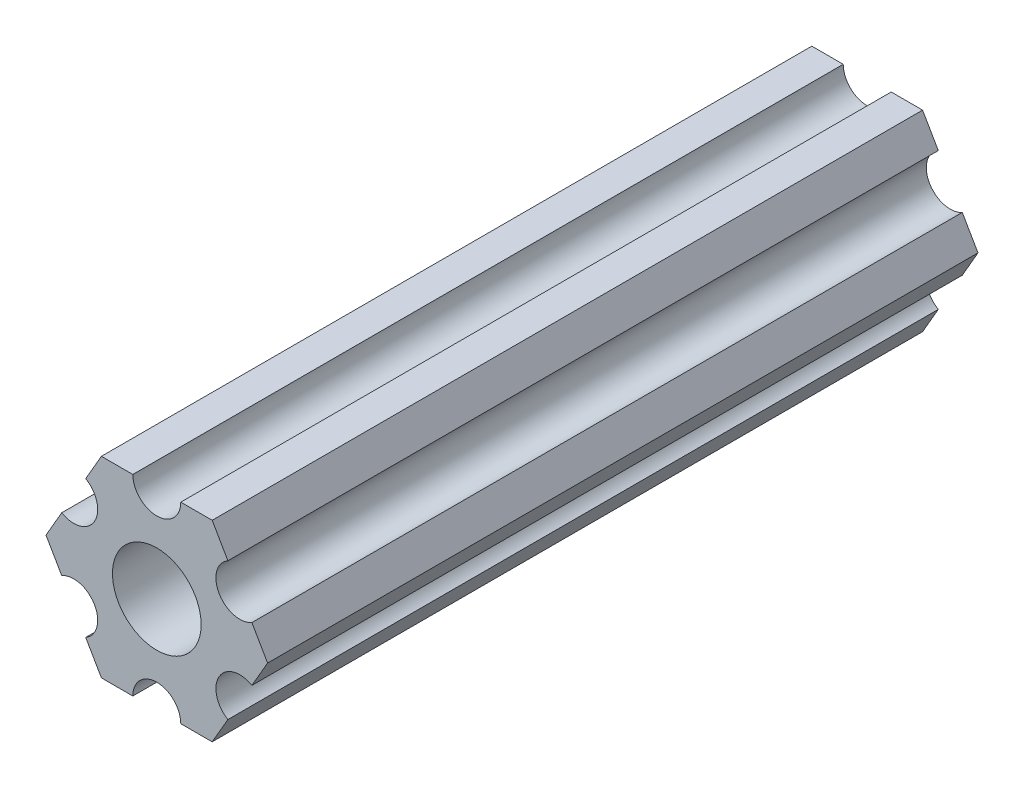
ISO-10303-21;
HEADER;
FILE_DESCRIPTION(('STEP AP214'),'2;1');
FILE_NAME('part.step','',(''),(''),'','','');
FILE_SCHEMA(('AUTOMOTIVE_DESIGN { 1 0 10303 214 1 1 1 1 }'));
ENDSEC;
DATA;
#1=APPLICATION_CONTEXT('core data for automotive mechanical design processes');
#2=APPLICATION_PROTOCOL_DEFINITION('international standard','automotive_design',2000,#1);
#3=PRODUCT_CONTEXT('',#1,'mechanical');
#4=PRODUCT('Part','Part','',(#3));
#5=PRODUCT_RELATED_PRODUCT_CATEGORY('part','',(#4));
#6=PRODUCT_DEFINITION_FORMATION('','',#4);
#7=PRODUCT_DEFINITION_CONTEXT('part definition',#1,'design');
#8=PRODUCT_DEFINITION('design','',#6,#7);
#9=PRODUCT_DEFINITION_SHAPE('','',#8);
#10=(LENGTH_UNIT() NAMED_UNIT(*) SI_UNIT(.MILLI.,.METRE.));
#11=(NAMED_UNIT(*) PLANE_ANGLE_UNIT() SI_UNIT($,.RADIAN.));
#12=(NAMED_UNIT(*) SI_UNIT($,.STERADIAN.) SOLID_ANGLE_UNIT());
#13=UNCERTAINTY_MEASURE_WITH_UNIT(LENGTH_MEASURE(1.E-05),#10,'distance_accuracy_value','');
#14=(GEOMETRIC_REPRESENTATION_CONTEXT(3) GLOBAL_UNCERTAINTY_ASSIGNED_CONTEXT((#13)) GLOBAL_UNIT_ASSIGNED_CONTEXT((#10,
#11,#12)) REPRESENTATION_CONTEXT('',''));
#15=CARTESIAN_POINT('',(0.,0.,0.));
#16=DIRECTION('',(0.,0.,1.));
#17=DIRECTION('',(1.,0.,0.));
#18=AXIS2_PLACEMENT_3D('',#15,#16,#17);
#19=CARTESIAN_POINT('',(5.49926123384919,-3.17500007340606,47.0154));
#20=DIRECTION('',(0.,0.,-1.));
#21=DIRECTION('',(-1.,0.,0.));
#22=AXIS2_PLACEMENT_3D('',#19,#20,#21);
#23=CYLINDRICAL_SURFACE('',#22,1.58750000000001);
#24=CARTESIAN_POINT('',(5.49926123384919,-3.17500007340606,0.));
#25=DIRECTION('',(0.,0.,1.));
#26=DIRECTION('',(1.,0.,0.));
#27=AXIS2_PLACEMENT_3D('',#24,#25,#26);
#28=CIRCLE('',#27,1.58750000000001);
#29=CARTESIAN_POINT('',(6.29301118896201,-1.80018471898264,0.));
#30=VERTEX_POINT('',#29);
#31=CARTESIAN_POINT('',(4.70551127873637,-4.54981542782949,0.));
#32=VERTEX_POINT('',#31);
#33=EDGE_CURVE('E189',#30,#32,#28,.T.);
#34=ORIENTED_EDGE('',*,*,#33,.F.);
#35=DIRECTION('',(0.,0.,-1.));
#36=VECTOR('',#35,1.);
#37=CARTESIAN_POINT('',(6.29301118896201,-1.80018471898264,47.0154));
#38=LINE('',#37,#36);
#39=CARTESIAN_POINT('',(6.29301118896201,-1.80018471898264,47.0154));
#40=VERTEX_POINT('',#39);
#41=EDGE_CURVE('E11',#40,#30,#38,.T.);
#42=ORIENTED_EDGE('',*,*,#41,.F.);
#43=CARTESIAN_POINT('',(5.49926123384919,-3.17500007340606,47.0154));
#44=DIRECTION('',(0.,0.,1.));
#45=DIRECTION('',(1.,0.,0.));
#46=AXIS2_PLACEMENT_3D('',#43,#44,#45);
#47=CIRCLE('',#46,1.58750000000001);
#48=CARTESIAN_POINT('',(4.70551127873637,-4.54981542782949,47.0154));
#49=VERTEX_POINT('',#48);
#50=EDGE_CURVE('E240',#40,#49,#47,.T.);
#51=ORIENTED_EDGE('',*,*,#50,.T.);
#52=DIRECTION('',(0.,0.,-1.));
#53=VECTOR('',#52,1.);
#54=CARTESIAN_POINT('',(4.70551127873637,-4.54981542782949,47.0154));
#55=LINE('',#54,#53);
#56=EDGE_CURVE('E35',#49,#32,#55,.T.);
#57=ORIENTED_EDGE('',*,*,#56,.T.);
#58=EDGE_LOOP('',(#34,#42,#51,#57));
#59=FACE_BOUND('',#58,.T.);
#60=ADVANCED_FACE('F32',(#59),#23,.F.);
#61=CARTESIAN_POINT('',(7.33234824269059,0.,47.0154));
#62=DIRECTION('',(0.866025420109243,-0.499999971724609,0.));
#63=DIRECTION('',(0.499999971724609,0.866025420109243,0.));
#64=AXIS2_PLACEMENT_3D('',#61,#62,#63);
#65=PLANE('',#64);
#66=DIRECTION('',(-0.499999971724609,-0.866025420109243,0.));
#67=VECTOR('',#66,1.);
#68=CARTESIAN_POINT('',(7.33234824269059,0.,0.));
#69=LINE('',#68,#67);
#70=CARTESIAN_POINT('',(7.33234824269059,0.,0.));
#71=VERTEX_POINT('',#70);
#72=EDGE_CURVE('E238',#71,#30,#69,.T.);
#73=ORIENTED_EDGE('',*,*,#72,.F.);
#74=DIRECTION('',(0.,0.,-1.));
#75=VECTOR('',#74,1.);
#76=CARTESIAN_POINT('',(7.33234824269059,0.,47.0154));
#77=LINE('',#76,#75);
#78=CARTESIAN_POINT('',(7.33234824269059,0.,47.0154));
#79=VERTEX_POINT('',#78);
#80=EDGE_CURVE('E41',#79,#71,#77,.T.);
#81=ORIENTED_EDGE('',*,*,#80,.F.);
#82=DIRECTION('',(-0.499999971724609,-0.866025420109243,0.));
#83=VECTOR('',#82,1.);
#84=CARTESIAN_POINT('',(7.33234824269059,0.,47.0154));
#85=LINE('',#84,#83);
#86=EDGE_CURVE('E179',#79,#40,#85,.T.);
#87=ORIENTED_EDGE('',*,*,#86,.T.);
#88=ORIENTED_EDGE('',*,*,#41,.T.);
#89=EDGE_LOOP('',(#73,#81,#87,#88));
#90=FACE_BOUND('',#89,.T.);
#91=ADVANCED_FACE('F272',(#90),#65,.T.);
#92=CARTESIAN_POINT('',(6.29301118896201,1.80018471898263,47.0154));
#93=DIRECTION('',(0.866025420109242,0.49999997172461,0.));
#94=DIRECTION('',(-0.49999997172461,0.866025420109242,0.));
#95=AXIS2_PLACEMENT_3D('',#92,#93,#94);
#96=PLANE('',#95);
#97=DIRECTION('',(0.49999997172461,-0.866025420109242,0.));
#98=VECTOR('',#97,1.);
#99=CARTESIAN_POINT('',(6.29301118896201,1.80018471898263,0.));
#100=LINE('',#99,#98);
#101=CARTESIAN_POINT('',(6.29301118896201,1.80018471898263,0.));
#102=VERTEX_POINT('',#101);
#103=EDGE_CURVE('E166',#102,#71,#100,.T.);
#104=ORIENTED_EDGE('',*,*,#103,.F.);
#105=DIRECTION('',(0.,0.,-1.));
#106=VECTOR('',#105,1.);
#107=CARTESIAN_POINT('',(6.29301118896201,1.80018471898263,47.0154));
#108=LINE('',#107,#106);
#109=CARTESIAN_POINT('',(6.29301118896201,1.80018471898263,47.0154));
#110=VERTEX_POINT('',#109);
#111=EDGE_CURVE('E161',#110,#102,#108,.T.);
#112=ORIENTED_EDGE('',*,*,#111,.F.);
#113=DIRECTION('',(0.49999997172461,-0.866025420109242,0.));
#114=VECTOR('',#113,1.);
#115=CARTESIAN_POINT('',(6.29301118896201,1.80018471898263,47.0154));
#116=LINE('',#115,#114);
#117=EDGE_CURVE('E164',#110,#79,#116,.T.);
#118=ORIENTED_EDGE('',*,*,#117,.T.);
#119=ORIENTED_EDGE('',*,*,#80,.T.);
#120=EDGE_LOOP('',(#104,#112,#118,#119));
#121=FACE_BOUND('',#120,.T.);
#122=ADVANCED_FACE('F163',(#121),#96,.T.);
#123=CARTESIAN_POINT('',(5.49926123384919,3.17500007340606,47.0154));
#124=DIRECTION('',(0.,0.,-1.));
#125=DIRECTION('',(-1.,0.,0.));
#126=AXIS2_PLACEMENT_3D('',#123,#124,#125);
#127=CYLINDRICAL_SURFACE('',#126,1.5875);
#128=CARTESIAN_POINT('',(5.49926123384919,3.17500007340606,0.));
#129=DIRECTION('',(0.,0.,1.));
#130=DIRECTION('',(1.,0.,0.));
#131=AXIS2_PLACEMENT_3D('',#128,#129,#130);
#132=CIRCLE('',#131,1.5875);
#133=CARTESIAN_POINT('',(4.70551127873637,4.54981542782948,0.));
#134=VERTEX_POINT('',#133);
#135=EDGE_CURVE('E235',#134,#102,#132,.T.);
#136=ORIENTED_EDGE('',*,*,#135,.F.);
#137=DIRECTION('',(0.,0.,-1.));
#138=VECTOR('',#137,1.);
#139=CARTESIAN_POINT('',(4.70551127873637,4.54981542782948,47.0154));
#140=LINE('',#139,#138);
#141=CARTESIAN_POINT('',(4.70551127873637,4.54981542782948,47.0154));
#142=VERTEX_POINT('',#141);
#143=EDGE_CURVE('E171',#142,#134,#140,.T.);
#144=ORIENTED_EDGE('',*,*,#143,.F.);
#145=CARTESIAN_POINT('',(5.49926123384919,3.17500007340606,47.0154));
#146=DIRECTION('',(0.,0.,1.));
#147=DIRECTION('',(1.,0.,0.));
#148=AXIS2_PLACEMENT_3D('',#145,#146,#147);
#149=CIRCLE('',#148,1.5875);
#150=EDGE_CURVE('E177',#142,#110,#149,.T.);
#151=ORIENTED_EDGE('',*,*,#150,.T.);
#152=ORIENTED_EDGE('',*,*,#111,.T.);
#153=EDGE_LOOP('',(#136,#144,#151,#152));
#154=FACE_BOUND('',#153,.T.);
#155=ADVANCED_FACE('F181',(#154),#127,.F.);
#156=CARTESIAN_POINT('',(3.6661742250078,6.35000014681211,47.0154));
#157=DIRECTION('',(0.866025420109242,0.499999971724609,0.));
#158=DIRECTION('',(-0.499999971724609,0.866025420109242,0.));
#159=AXIS2_PLACEMENT_3D('',#156,#157,#158);
#160=PLANE('',#159);
#161=DIRECTION('',(0.49999997172461,-0.866025420109242,0.));
#162=VECTOR('',#161,1.);
#163=CARTESIAN_POINT('',(3.6661742250078,6.35000014681211,0.));
#164=LINE('',#163,#162);
#165=CARTESIAN_POINT('',(3.6661742250078,6.35000014681211,0.));
#166=VERTEX_POINT('',#165);
#167=EDGE_CURVE('E232',#166,#134,#164,.T.);
#168=ORIENTED_EDGE('',*,*,#167,.F.);
#169=DIRECTION('',(0.,0.,-1.));
#170=VECTOR('',#169,1.);
#171=CARTESIAN_POINT('',(3.6661742250078,6.35000014681211,47.0154));
#172=LINE('',#171,#170);
#173=CARTESIAN_POINT('',(3.6661742250078,6.35000014681211,47.0154));
#174=VERTEX_POINT('',#173);
#175=EDGE_CURVE('E244',#174,#166,#172,.T.);
#176=ORIENTED_EDGE('',*,*,#175,.F.);
#177=DIRECTION('',(0.49999997172461,-0.866025420109242,0.));
#178=VECTOR('',#177,1.);
#179=CARTESIAN_POINT('',(3.6661742250078,6.35000014681211,47.0154));
#180=LINE('',#179,#178);
#181=EDGE_CURVE('E182',#174,#142,#180,.T.);
#182=ORIENTED_EDGE('',*,*,#181,.T.);
#183=ORIENTED_EDGE('',*,*,#143,.T.);
#184=EDGE_LOOP('',(#168,#176,#182,#183));
#185=FACE_BOUND('',#184,.T.);
#186=ADVANCED_FACE('F285',(#185),#160,.T.);
#187=CARTESIAN_POINT('',(1.5875,6.35000014681211,47.0154));
#188=DIRECTION('',(0.,1.,0.));
#189=DIRECTION('',(0.,0.,1.));
#190=AXIS2_PLACEMENT_3D('',#187,#188,#189);
#191=PLANE('',#190);
#192=DIRECTION('',(1.,0.,0.));
#193=VECTOR('',#192,1.);
#194=CARTESIAN_POINT('',(1.5875,6.35000014681211,0.));
#195=LINE('',#194,#193);
#196=CARTESIAN_POINT('',(1.5875,6.35000014681211,0.));
#197=VERTEX_POINT('',#196);
#198=EDGE_CURVE('E229',#197,#166,#195,.T.);
#199=ORIENTED_EDGE('',*,*,#198,.F.);
#200=DIRECTION('',(0.,0.,-1.));
#201=VECTOR('',#200,1.);
#202=CARTESIAN_POINT('',(1.5875,6.35000014681211,47.0154));
#203=LINE('',#202,#201);
#204=CARTESIAN_POINT('',(1.5875,6.35000014681211,47.0154));
#205=VERTEX_POINT('',#204);
#206=EDGE_CURVE('E246',#205,#197,#203,.T.);
#207=ORIENTED_EDGE('',*,*,#206,.F.);
#208=DIRECTION('',(1.,0.,0.));
#209=VECTOR('',#208,1.);
#210=CARTESIAN_POINT('',(1.5875,6.35000014681211,47.0154));
#211=LINE('',#210,#209);
#212=EDGE_CURVE('E184',#205,#174,#211,.T.);
#213=ORIENTED_EDGE('',*,*,#212,.T.);
#214=ORIENTED_EDGE('',*,*,#175,.T.);
#215=EDGE_LOOP('',(#199,#207,#213,#214));
#216=FACE_BOUND('',#215,.T.);
#217=ADVANCED_FACE('F288',(#216),#191,.T.);
#218=CARTESIAN_POINT('',(0.,6.35000014681211,47.0154));
#219=DIRECTION('',(0.,0.,-1.));
#220=DIRECTION('',(-1.,0.,0.));
#221=AXIS2_PLACEMENT_3D('',#218,#219,#220);
#222=CYLINDRICAL_SURFACE('',#221,1.5875);
#223=CARTESIAN_POINT('',(0.,6.35000014681211,0.));
#224=DIRECTION('',(0.,0.,1.));
#225=DIRECTION('',(1.,0.,0.));
#226=AXIS2_PLACEMENT_3D('',#223,#224,#225);
#227=CIRCLE('',#226,1.5875);
#228=CARTESIAN_POINT('',(-1.5875,6.35000014681211,0.));
#229=VERTEX_POINT('',#228);
#230=EDGE_CURVE('E226',#229,#197,#227,.T.);
#231=ORIENTED_EDGE('',*,*,#230,.F.);
#232=DIRECTION('',(0.,0.,-1.));
#233=VECTOR('',#232,1.);
#234=CARTESIAN_POINT('',(-1.5875,6.35000014681211,47.0154));
#235=LINE('',#234,#233);
#236=CARTESIAN_POINT('',(-1.5875,6.35000014681211,47.0154));
#237=VERTEX_POINT('',#236);
#238=EDGE_CURVE('E248',#237,#229,#235,.T.);
#239=ORIENTED_EDGE('',*,*,#238,.F.);
#240=CARTESIAN_POINT('',(0.,6.35000014681211,47.0154));
#241=DIRECTION('',(0.,0.,1.));
#242=DIRECTION('',(1.,0.,0.));
#243=AXIS2_PLACEMENT_3D('',#240,#241,#242);
#244=CIRCLE('',#243,1.5875);
#245=EDGE_CURVE('E393',#237,#205,#244,.T.);
#246=ORIENTED_EDGE('',*,*,#245,.T.);
#247=ORIENTED_EDGE('',*,*,#206,.T.);
#248=EDGE_LOOP('',(#231,#239,#246,#247));
#249=FACE_BOUND('',#248,.T.);
#250=ADVANCED_FACE('F292',(#249),#222,.F.);
#251=CARTESIAN_POINT('',(-3.6661742250078,6.35000014681211,47.0154));
#252=DIRECTION('',(0.,1.,0.));
#253=DIRECTION('',(0.,0.,1.));
#254=AXIS2_PLACEMENT_3D('',#251,#252,#253);
#255=PLANE('',#254);
#256=DIRECTION('',(1.,0.,0.));
#257=VECTOR('',#256,1.);
#258=CARTESIAN_POINT('',(-3.6661742250078,6.35000014681211,0.));
#259=LINE('',#258,#257);
#260=CARTESIAN_POINT('',(-3.6661742250078,6.35000014681211,0.));
#261=VERTEX_POINT('',#260);
#262=EDGE_CURVE('E223',#261,#229,#259,.T.);
#263=ORIENTED_EDGE('',*,*,#262,.F.);
#264=DIRECTION('',(0.,0.,-1.));
#265=VECTOR('',#264,1.);
#266=CARTESIAN_POINT('',(-3.6661742250078,6.35000014681211,47.0154));
#267=LINE('',#266,#265);
#268=CARTESIAN_POINT('',(-3.6661742250078,6.35000014681211,47.0154));
#269=VERTEX_POINT('',#268);
#270=EDGE_CURVE('E250',#269,#261,#267,.T.);
#271=ORIENTED_EDGE('',*,*,#270,.F.);
#272=DIRECTION('',(1.,0.,0.));
#273=VECTOR('',#272,1.);
#274=CARTESIAN_POINT('',(-3.6661742250078,6.35000014681211,47.0154));
#275=LINE('',#274,#273);
#276=EDGE_CURVE('E390',#269,#237,#275,.T.);
#277=ORIENTED_EDGE('',*,*,#276,.T.);
#278=ORIENTED_EDGE('',*,*,#238,.T.);
#279=EDGE_LOOP('',(#263,#271,#277,#278));
#280=FACE_BOUND('',#279,.T.);
#281=ADVANCED_FACE('F296',(#280),#255,.T.);
#282=CARTESIAN_POINT('',(-4.70551127873637,4.54981542782948,47.0154));
#283=DIRECTION('',(-0.866025420109242,0.499999971724609,0.));
#284=DIRECTION('',(-0.499999971724609,-0.866025420109242,0.));
#285=AXIS2_PLACEMENT_3D('',#282,#283,#284);
#286=PLANE('',#285);
#287=DIRECTION('',(0.49999997172461,0.866025420109242,0.));
#288=VECTOR('',#287,1.);
#289=CARTESIAN_POINT('',(-4.70551127873637,4.54981542782948,0.));
#290=LINE('',#289,#288);
#291=CARTESIAN_POINT('',(-4.70551127873637,4.54981542782948,0.));
#292=VERTEX_POINT('',#291);
#293=EDGE_CURVE('E220',#292,#261,#290,.T.);
#294=ORIENTED_EDGE('',*,*,#293,.F.);
#295=DIRECTION('',(0.,0.,-1.));
#296=VECTOR('',#295,1.);
#297=CARTESIAN_POINT('',(-4.70551127873637,4.54981542782948,47.0154));
#298=LINE('',#297,#296);
#299=CARTESIAN_POINT('',(-4.70551127873637,4.54981542782948,47.0154));
#300=VERTEX_POINT('',#299);
#301=EDGE_CURVE('E252',#300,#292,#298,.T.);
#302=ORIENTED_EDGE('',*,*,#301,.F.);
#303=DIRECTION('',(0.49999997172461,0.866025420109242,0.));
#304=VECTOR('',#303,1.);
#305=CARTESIAN_POINT('',(-4.70551127873637,4.54981542782948,47.0154));
#306=LINE('',#305,#304);
#307=EDGE_CURVE('E387',#300,#269,#306,.T.);
#308=ORIENTED_EDGE('',*,*,#307,.T.);
#309=ORIENTED_EDGE('',*,*,#270,.T.);
#310=EDGE_LOOP('',(#294,#302,#308,#309));
#311=FACE_BOUND('',#310,.T.);
#312=ADVANCED_FACE('F300',(#311),#286,.T.);
#313=CARTESIAN_POINT('',(-5.49926123384919,3.17500007340605,47.0154));
#314=DIRECTION('',(0.,0.,-1.));
#315=DIRECTION('',(-1.,0.,0.));
#316=AXIS2_PLACEMENT_3D('',#313,#314,#315);
#317=CYLINDRICAL_SURFACE('',#316,1.5875);
#318=CARTESIAN_POINT('',(-5.49926123384919,3.17500007340605,0.));
#319=DIRECTION('',(0.,0.,1.));
#320=DIRECTION('',(1.,0.,0.));
#321=AXIS2_PLACEMENT_3D('',#318,#319,#320);
#322=CIRCLE('',#321,1.5875);
#323=CARTESIAN_POINT('',(-6.29301118896201,1.80018471898263,0.));
#324=VERTEX_POINT('',#323);
#325=EDGE_CURVE('E217',#324,#292,#322,.T.);
#326=ORIENTED_EDGE('',*,*,#325,.F.);
#327=DIRECTION('',(0.,0.,-1.));
#328=VECTOR('',#327,1.);
#329=CARTESIAN_POINT('',(-6.29301118896201,1.80018471898263,47.0154));
#330=LINE('',#329,#328);
#331=CARTESIAN_POINT('',(-6.29301118896201,1.80018471898263,47.0154));
#332=VERTEX_POINT('',#331);
#333=EDGE_CURVE('E254',#332,#324,#330,.T.);
#334=ORIENTED_EDGE('',*,*,#333,.F.);
#335=CARTESIAN_POINT('',(-5.49926123384919,3.17500007340605,47.0154));
#336=DIRECTION('',(0.,0.,1.));
#337=DIRECTION('',(1.,0.,0.));
#338=AXIS2_PLACEMENT_3D('',#335,#336,#337);
#339=CIRCLE('',#338,1.5875);
#340=EDGE_CURVE('E384',#332,#300,#339,.T.);
#341=ORIENTED_EDGE('',*,*,#340,.T.);
#342=ORIENTED_EDGE('',*,*,#301,.T.);
#343=EDGE_LOOP('',(#326,#334,#341,#342));
#344=FACE_BOUND('',#343,.T.);
#345=ADVANCED_FACE('F304',(#344),#317,.F.);
#346=CARTESIAN_POINT('',(-7.33234824269059,0.,47.0154));
#347=DIRECTION('',(-0.866025420109242,0.49999997172461,0.));
#348=DIRECTION('',(-0.49999997172461,-0.866025420109242,0.));
#349=AXIS2_PLACEMENT_3D('',#346,#347,#348);
#350=PLANE('',#349);
#351=DIRECTION('',(0.49999997172461,0.866025420109242,0.));
#352=VECTOR('',#351,1.);
#353=CARTESIAN_POINT('',(-7.33234824269059,0.,0.));
#354=LINE('',#353,#352);
#355=CARTESIAN_POINT('',(-7.33234824269059,0.,0.));
#356=VERTEX_POINT('',#355);
#357=EDGE_CURVE('E214',#356,#324,#354,.T.);
#358=ORIENTED_EDGE('',*,*,#357,.F.);
#359=DIRECTION('',(0.,0.,-1.));
#360=VECTOR('',#359,1.);
#361=CARTESIAN_POINT('',(-7.33234824269059,0.,47.0154));
#362=LINE('',#361,#360);
#363=CARTESIAN_POINT('',(-7.33234824269059,0.,47.0154));
#364=VERTEX_POINT('',#363);
#365=EDGE_CURVE('E256',#364,#356,#362,.T.);
#366=ORIENTED_EDGE('',*,*,#365,.F.);
#367=DIRECTION('',(0.49999997172461,0.866025420109242,0.));
#368=VECTOR('',#367,1.);
#369=CARTESIAN_POINT('',(-7.33234824269059,0.,47.0154));
#370=LINE('',#369,#368);
#371=EDGE_CURVE('E381',#364,#332,#370,.T.);
#372=ORIENTED_EDGE('',*,*,#371,.T.);
#373=ORIENTED_EDGE('',*,*,#333,.T.);
#374=EDGE_LOOP('',(#358,#366,#372,#373));
#375=FACE_BOUND('',#374,.T.);
#376=ADVANCED_FACE('F308',(#375),#350,.T.);
#377=CARTESIAN_POINT('',(-6.29301118896201,-1.80018471898264,47.0154));
#378=DIRECTION('',(-0.866025420109243,-0.499999971724609,0.));
#379=DIRECTION('',(0.499999971724609,-0.866025420109243,0.));
#380=AXIS2_PLACEMENT_3D('',#377,#378,#379);
#381=PLANE('',#380);
#382=DIRECTION('',(-0.499999971724609,0.866025420109243,0.));
#383=VECTOR('',#382,1.);
#384=CARTESIAN_POINT('',(-6.29301118896201,-1.80018471898264,0.));
#385=LINE('',#384,#383);
#386=CARTESIAN_POINT('',(-6.29301118896201,-1.80018471898264,0.));
#387=VERTEX_POINT('',#386);
#388=EDGE_CURVE('E211',#387,#356,#385,.T.);
#389=ORIENTED_EDGE('',*,*,#388,.F.);
#390=DIRECTION('',(0.,0.,-1.));
#391=VECTOR('',#390,1.);
#392=CARTESIAN_POINT('',(-6.29301118896201,-1.80018471898264,47.0154));
#393=LINE('',#392,#391);
#394=CARTESIAN_POINT('',(-6.29301118896201,-1.80018471898264,47.0154));
#395=VERTEX_POINT('',#394);
#396=EDGE_CURVE('E258',#395,#387,#393,.T.);
#397=ORIENTED_EDGE('',*,*,#396,.F.);
#398=DIRECTION('',(-0.499999971724609,0.866025420109243,0.));
#399=VECTOR('',#398,1.);
#400=CARTESIAN_POINT('',(-6.29301118896201,-1.80018471898264,47.0154));
#401=LINE('',#400,#399);
#402=EDGE_CURVE('E378',#395,#364,#401,.T.);
#403=ORIENTED_EDGE('',*,*,#402,.T.);
#404=ORIENTED_EDGE('',*,*,#365,.T.);
#405=EDGE_LOOP('',(#389,#397,#403,#404));
#406=FACE_BOUND('',#405,.T.);
#407=ADVANCED_FACE('F312',(#406),#381,.T.);
#408=CARTESIAN_POINT('',(-5.49926123384919,-3.17500007340606,47.0154));
#409=DIRECTION('',(0.,0.,-1.));
#410=DIRECTION('',(-1.,0.,0.));
#411=AXIS2_PLACEMENT_3D('',#408,#409,#410);
#412=CYLINDRICAL_SURFACE('',#411,1.58750000000001);
#413=CARTESIAN_POINT('',(-5.49926123384919,-3.17500007340606,0.));
#414=DIRECTION('',(0.,0.,1.));
#415=DIRECTION('',(1.,0.,0.));
#416=AXIS2_PLACEMENT_3D('',#413,#414,#415);
#417=CIRCLE('',#416,1.58750000000001);
#418=CARTESIAN_POINT('',(-4.70551127873637,-4.54981542782949,0.));
#419=VERTEX_POINT('',#418);
#420=EDGE_CURVE('E208',#419,#387,#417,.T.);
#421=ORIENTED_EDGE('',*,*,#420,.F.);
#422=DIRECTION('',(0.,0.,-1.));
#423=VECTOR('',#422,1.);
#424=CARTESIAN_POINT('',(-4.70551127873637,-4.54981542782949,47.0154));
#425=LINE('',#424,#423);
#426=CARTESIAN_POINT('',(-4.70551127873637,-4.54981542782949,47.0154));
#427=VERTEX_POINT('',#426);
#428=EDGE_CURVE('E260',#427,#419,#425,.T.);
#429=ORIENTED_EDGE('',*,*,#428,.F.);
#430=CARTESIAN_POINT('',(-5.49926123384919,-3.17500007340606,47.0154));
#431=DIRECTION('',(0.,0.,1.));
#432=DIRECTION('',(1.,0.,0.));
#433=AXIS2_PLACEMENT_3D('',#430,#431,#432);
#434=CIRCLE('',#433,1.58750000000001);
#435=EDGE_CURVE('E375',#427,#395,#434,.T.);
#436=ORIENTED_EDGE('',*,*,#435,.T.);
#437=ORIENTED_EDGE('',*,*,#396,.T.);
#438=EDGE_LOOP('',(#421,#429,#436,#437));
#439=FACE_BOUND('',#438,.T.);
#440=ADVANCED_FACE('F316',(#439),#412,.F.);
#441=CARTESIAN_POINT('',(-3.6661742250078,-6.35000014681213,47.0154));
#442=DIRECTION('',(-0.866025420109243,-0.499999971724609,0.));
#443=DIRECTION('',(0.499999971724609,-0.866025420109243,0.));
#444=AXIS2_PLACEMENT_3D('',#441,#442,#443);
#445=PLANE('',#444);
#446=DIRECTION('',(-0.499999971724609,0.866025420109243,0.));
#447=VECTOR('',#446,1.);
#448=CARTESIAN_POINT('',(-3.6661742250078,-6.35000014681213,0.));
#449=LINE('',#448,#447);
#450=CARTESIAN_POINT('',(-3.6661742250078,-6.35000014681213,0.));
#451=VERTEX_POINT('',#450);
#452=EDGE_CURVE('E205',#451,#419,#449,.T.);
#453=ORIENTED_EDGE('',*,*,#452,.F.);
#454=DIRECTION('',(0.,0.,-1.));
#455=VECTOR('',#454,1.);
#456=CARTESIAN_POINT('',(-3.6661742250078,-6.35000014681213,47.0154));
#457=LINE('',#456,#455);
#458=CARTESIAN_POINT('',(-3.6661742250078,-6.35000014681213,47.0154));
#459=VERTEX_POINT('',#458);
#460=EDGE_CURVE('E262',#459,#451,#457,.T.);
#461=ORIENTED_EDGE('',*,*,#460,.F.);
#462=DIRECTION('',(-0.499999971724609,0.866025420109243,0.));
#463=VECTOR('',#462,1.);
#464=CARTESIAN_POINT('',(-3.6661742250078,-6.35000014681213,47.0154));
#465=LINE('',#464,#463);
#466=EDGE_CURVE('E372',#459,#427,#465,.T.);
#467=ORIENTED_EDGE('',*,*,#466,.T.);
#468=ORIENTED_EDGE('',*,*,#428,.T.);
#469=EDGE_LOOP('',(#453,#461,#467,#468));
#470=FACE_BOUND('',#469,.T.);
#471=ADVANCED_FACE('F320',(#470),#445,.T.);
#472=CARTESIAN_POINT('',(-1.5875,-6.35000014681213,47.0154));
#473=DIRECTION('',(0.,-1.,0.));
#474=DIRECTION('',(0.,0.,-1.));
#475=AXIS2_PLACEMENT_3D('',#472,#473,#474);
#476=PLANE('',#475);
#477=DIRECTION('',(-1.,0.,0.));
#478=VECTOR('',#477,1.);
#479=CARTESIAN_POINT('',(-1.5875,-6.35000014681213,0.));
#480=LINE('',#479,#478);
#481=CARTESIAN_POINT('',(-1.5875,-6.35000014681213,0.));
#482=VERTEX_POINT('',#481);
#483=EDGE_CURVE('E202',#482,#451,#480,.T.);
#484=ORIENTED_EDGE('',*,*,#483,.F.);
#485=DIRECTION('',(0.,0.,-1.));
#486=VECTOR('',#485,1.);
#487=CARTESIAN_POINT('',(-1.5875,-6.35000014681213,47.0154));
#488=LINE('',#487,#486);
#489=CARTESIAN_POINT('',(-1.5875,-6.35000014681213,47.0154));
#490=VERTEX_POINT('',#489);
#491=EDGE_CURVE('E264',#490,#482,#488,.T.);
#492=ORIENTED_EDGE('',*,*,#491,.F.);
#493=DIRECTION('',(-1.,0.,0.));
#494=VECTOR('',#493,1.);
#495=CARTESIAN_POINT('',(-1.5875,-6.35000014681213,47.0154));
#496=LINE('',#495,#494);
#497=EDGE_CURVE('E369',#490,#459,#496,.T.);
#498=ORIENTED_EDGE('',*,*,#497,.T.);
#499=ORIENTED_EDGE('',*,*,#460,.T.);
#500=EDGE_LOOP('',(#484,#492,#498,#499));
#501=FACE_BOUND('',#500,.T.);
#502=ADVANCED_FACE('F324',(#501),#476,.T.);
#503=CARTESIAN_POINT('',(0.,-6.35000014681213,47.0154));
#504=DIRECTION('',(0.,0.,-1.));
#505=DIRECTION('',(-1.,0.,0.));
#506=AXIS2_PLACEMENT_3D('',#503,#504,#505);
#507=CYLINDRICAL_SURFACE('',#506,1.5875);
#508=CARTESIAN_POINT('',(0.,-6.35000014681213,0.));
#509=DIRECTION('',(0.,0.,1.));
#510=DIRECTION('',(1.,0.,0.));
#511=AXIS2_PLACEMENT_3D('',#508,#509,#510);
#512=CIRCLE('',#511,1.5875);
#513=CARTESIAN_POINT('',(1.5875,-6.35000014681213,0.));
#514=VERTEX_POINT('',#513);
#515=EDGE_CURVE('E199',#514,#482,#512,.T.);
#516=ORIENTED_EDGE('',*,*,#515,.F.);
#517=DIRECTION('',(0.,0.,-1.));
#518=VECTOR('',#517,1.);
#519=CARTESIAN_POINT('',(1.5875,-6.35000014681213,47.0154));
#520=LINE('',#519,#518);
#521=CARTESIAN_POINT('',(1.5875,-6.35000014681213,47.0154));
#522=VERTEX_POINT('',#521);
#523=EDGE_CURVE('E266',#522,#514,#520,.T.);
#524=ORIENTED_EDGE('',*,*,#523,.F.);
#525=CARTESIAN_POINT('',(0.,-6.35000014681213,47.0154));
#526=DIRECTION('',(0.,0.,1.));
#527=DIRECTION('',(1.,0.,0.));
#528=AXIS2_PLACEMENT_3D('',#525,#526,#527);
#529=CIRCLE('',#528,1.5875);
#530=EDGE_CURVE('E366',#522,#490,#529,.T.);
#531=ORIENTED_EDGE('',*,*,#530,.T.);
#532=ORIENTED_EDGE('',*,*,#491,.T.);
#533=EDGE_LOOP('',(#516,#524,#531,#532));
#534=FACE_BOUND('',#533,.T.);
#535=ADVANCED_FACE('F328',(#534),#507,.F.);
#536=CARTESIAN_POINT('',(3.6661742250078,-6.35000014681213,47.0154));
#537=DIRECTION('',(0.,-1.,0.));
#538=DIRECTION('',(0.,0.,-1.));
#539=AXIS2_PLACEMENT_3D('',#536,#537,#538);
#540=PLANE('',#539);
#541=DIRECTION('',(-1.,0.,0.));
#542=VECTOR('',#541,1.);
#543=CARTESIAN_POINT('',(3.6661742250078,-6.35000014681213,0.));
#544=LINE('',#543,#542);
#545=CARTESIAN_POINT('',(3.6661742250078,-6.35000014681213,0.));
#546=VERTEX_POINT('',#545);
#547=EDGE_CURVE('E196',#546,#514,#544,.T.);
#548=ORIENTED_EDGE('',*,*,#547,.F.);
#549=DIRECTION('',(0.,0.,-1.));
#550=VECTOR('',#549,1.);
#551=CARTESIAN_POINT('',(3.6661742250078,-6.35000014681213,47.0154));
#552=LINE('',#551,#550);
#553=CARTESIAN_POINT('',(3.6661742250078,-6.35000014681213,47.0154));
#554=VERTEX_POINT('',#553);
#555=EDGE_CURVE('E267',#554,#546,#552,.T.);
#556=ORIENTED_EDGE('',*,*,#555,.F.);
#557=DIRECTION('',(-1.,0.,0.));
#558=VECTOR('',#557,1.);
#559=CARTESIAN_POINT('',(3.6661742250078,-6.35000014681213,47.0154));
#560=LINE('',#559,#558);
#561=EDGE_CURVE('E363',#554,#522,#560,.T.);
#562=ORIENTED_EDGE('',*,*,#561,.T.);
#563=ORIENTED_EDGE('',*,*,#523,.T.);
#564=EDGE_LOOP('',(#548,#556,#562,#563));
#565=FACE_BOUND('',#564,.T.);
#566=ADVANCED_FACE('F332',(#565),#540,.T.);
#567=CARTESIAN_POINT('',(4.70551127873637,-4.54981542782949,47.0154));
#568=DIRECTION('',(0.866025420109243,-0.499999971724609,0.));
#569=DIRECTION('',(0.499999971724609,0.866025420109243,0.));
#570=AXIS2_PLACEMENT_3D('',#567,#568,#569);
#571=PLANE('',#570);
#572=DIRECTION('',(-0.499999971724609,-0.866025420109243,0.));
#573=VECTOR('',#572,1.);
#574=CARTESIAN_POINT('',(4.70551127873637,-4.54981542782949,0.));
#575=LINE('',#574,#573);
#576=EDGE_CURVE('E192',#32,#546,#575,.T.);
#577=ORIENTED_EDGE('',*,*,#576,.F.);
#578=ORIENTED_EDGE('',*,*,#56,.F.);
#579=DIRECTION('',(-0.499999971724609,-0.866025420109243,0.));
#580=VECTOR('',#579,1.);
#581=CARTESIAN_POINT('',(4.70551127873637,-4.54981542782949,47.0154));
#582=LINE('',#581,#580);
#583=EDGE_CURVE('E361',#49,#554,#582,.T.);
#584=ORIENTED_EDGE('',*,*,#583,.T.);
#585=ORIENTED_EDGE('',*,*,#555,.T.);
#586=EDGE_LOOP('',(#577,#578,#584,#585));
#587=FACE_BOUND('',#586,.T.);
#588=ADVANCED_FACE('F269',(#587),#571,.T.);
#589=CARTESIAN_POINT('',(5.49926123384919,-3.17500007340606,47.0154));
#590=DIRECTION('',(0.,0.,1.));
#591=DIRECTION('',(1.,0.,0.));
#592=AXIS2_PLACEMENT_3D('',#589,#590,#591);
#593=PLANE('',#592);
#594=CARTESIAN_POINT('',(0.,0.,47.0154));
#595=DIRECTION('',(0.,0.,-1.));
#596=DIRECTION('',(1.,0.,0.));
#597=AXIS2_PLACEMENT_3D('',#594,#595,#596);
#598=CIRCLE('',#597,2.9337);
#599=CARTESIAN_POINT('',(2.9337,0.,47.0154));
#600=VERTEX_POINT('',#599);
#601=EDGE_CURVE('E193',#600,#600,#598,.T.);
#602=ORIENTED_EDGE('',*,*,#601,.T.);
#603=EDGE_LOOP('',(#602));
#604=FACE_BOUND('',#603,.T.);
#605=ORIENTED_EDGE('',*,*,#50,.F.);
#606=ORIENTED_EDGE('',*,*,#86,.F.);
#607=ORIENTED_EDGE('',*,*,#117,.F.);
#608=ORIENTED_EDGE('',*,*,#150,.F.);
#609=ORIENTED_EDGE('',*,*,#181,.F.);
#610=ORIENTED_EDGE('',*,*,#212,.F.);
#611=ORIENTED_EDGE('',*,*,#245,.F.);
#612=ORIENTED_EDGE('',*,*,#276,.F.);
#613=ORIENTED_EDGE('',*,*,#307,.F.);
#614=ORIENTED_EDGE('',*,*,#340,.F.);
#615=ORIENTED_EDGE('',*,*,#371,.F.);
#616=ORIENTED_EDGE('',*,*,#402,.F.);
#617=ORIENTED_EDGE('',*,*,#435,.F.);
#618=ORIENTED_EDGE('',*,*,#466,.F.);
#619=ORIENTED_EDGE('',*,*,#497,.F.);
#620=ORIENTED_EDGE('',*,*,#530,.F.);
#621=ORIENTED_EDGE('',*,*,#561,.F.);
#622=ORIENTED_EDGE('',*,*,#583,.F.);
#623=EDGE_LOOP('',(#605,#606,#607,#608,#609,#610,#611,#612,#613,#614,#615,#616,#617,#618,#619,
#620,#621,#622));
#624=FACE_BOUND('',#623,.T.);
#625=ADVANCED_FACE('F175',(#604,#624),#593,.T.);
#626=CARTESIAN_POINT('',(5.49926123384919,-3.17500007340606,0.));
#627=DIRECTION('',(0.,0.,1.));
#628=DIRECTION('',(1.,0.,0.));
#629=AXIS2_PLACEMENT_3D('',#626,#627,#628);
#630=PLANE('',#629);
#631=CARTESIAN_POINT('',(0.,0.,0.));
#632=DIRECTION('',(0.,0.,-1.));
#633=DIRECTION('',(1.,0.,0.));
#634=AXIS2_PLACEMENT_3D('',#631,#632,#633);
#635=CIRCLE('',#634,2.9337);
#636=CARTESIAN_POINT('',(2.9337,0.,0.));
#637=VERTEX_POINT('',#636);
#638=EDGE_CURVE('E356',#637,#637,#635,.T.);
#639=ORIENTED_EDGE('',*,*,#638,.F.);
#640=EDGE_LOOP('',(#639));
#641=FACE_BOUND('',#640,.T.);
#642=ORIENTED_EDGE('',*,*,#33,.T.);
#643=ORIENTED_EDGE('',*,*,#576,.T.);
#644=ORIENTED_EDGE('',*,*,#547,.T.);
#645=ORIENTED_EDGE('',*,*,#515,.T.);
#646=ORIENTED_EDGE('',*,*,#483,.T.);
#647=ORIENTED_EDGE('',*,*,#452,.T.);
#648=ORIENTED_EDGE('',*,*,#420,.T.);
#649=ORIENTED_EDGE('',*,*,#388,.T.);
#650=ORIENTED_EDGE('',*,*,#357,.T.);
#651=ORIENTED_EDGE('',*,*,#325,.T.);
#652=ORIENTED_EDGE('',*,*,#293,.T.);
#653=ORIENTED_EDGE('',*,*,#262,.T.);
#654=ORIENTED_EDGE('',*,*,#230,.T.);
#655=ORIENTED_EDGE('',*,*,#198,.T.);
#656=ORIENTED_EDGE('',*,*,#167,.T.);
#657=ORIENTED_EDGE('',*,*,#135,.T.);
#658=ORIENTED_EDGE('',*,*,#103,.T.);
#659=ORIENTED_EDGE('',*,*,#72,.T.);
#660=EDGE_LOOP('',(#642,#643,#644,#645,#646,#647,#648,#649,#650,#651,#652,#653,#654,#655,#656,
#657,#658,#659));
#661=FACE_BOUND('',#660,.T.);
#662=ADVANCED_FACE('F271',(#641,#661),#630,.F.);
#663=CARTESIAN_POINT('',(0.,0.,47.0154));
#664=DIRECTION('',(0.,0.,-1.));
#665=DIRECTION('',(-1.,0.,0.));
#666=AXIS2_PLACEMENT_3D('',#663,#664,#665);
#667=CYLINDRICAL_SURFACE('',#666,2.9337);
#668=ORIENTED_EDGE('',*,*,#601,.F.);
#669=EDGE_LOOP('',(#668));
#670=FACE_BOUND('',#669,.T.);
#671=ORIENTED_EDGE('',*,*,#638,.T.);
#672=EDGE_LOOP('',(#671));
#673=FACE_BOUND('',#672,.T.);
#674=ADVANCED_FACE('F344',(#670,#673),#667,.F.);
#675=CLOSED_SHELL('',(#60,#91,#122,#155,#186,#217,#250,#281,#312,#345,#376,#407,#440,#471,#502,
#535,#566,#588,#625,#662,#674));
#676=MANIFOLD_SOLID_BREP('B2',#675);
#677=ADVANCED_BREP_SHAPE_REPRESENTATION('',(#18,#676),#14);
#678=SHAPE_DEFINITION_REPRESENTATION(#9,#677);
ENDSEC;
END-ISO-10303-21;
